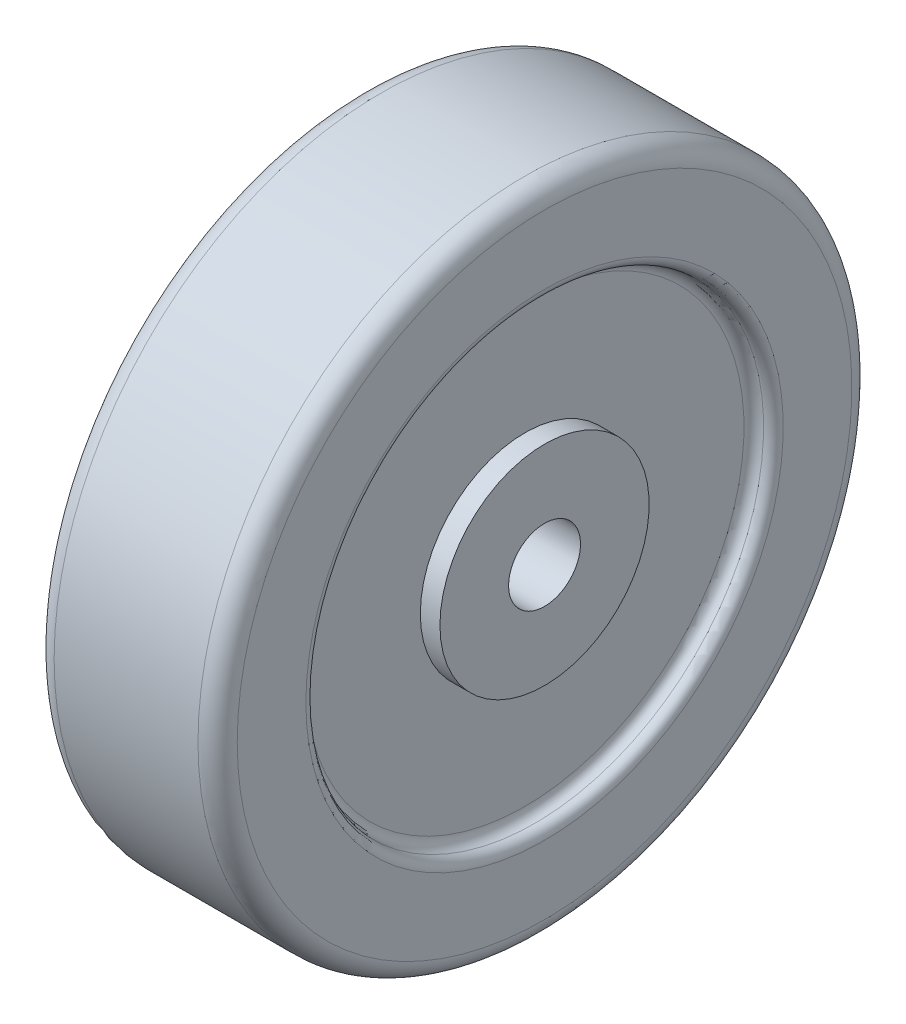
ISO-10303-21;
HEADER;
FILE_DESCRIPTION(('STEP AP214'),'2;1');
FILE_NAME('part.step','',(''),(''),'','','');
FILE_SCHEMA(('AUTOMOTIVE_DESIGN { 1 0 10303 214 1 1 1 1 }'));
ENDSEC;
DATA;
#1=APPLICATION_CONTEXT('core data for automotive mechanical design processes');
#2=APPLICATION_PROTOCOL_DEFINITION('international standard','automotive_design',2000,#1);
#3=PRODUCT_CONTEXT('',#1,'mechanical');
#4=PRODUCT('Part','Part','',(#3));
#5=PRODUCT_RELATED_PRODUCT_CATEGORY('part','',(#4));
#6=PRODUCT_DEFINITION_FORMATION('','',#4);
#7=PRODUCT_DEFINITION_CONTEXT('part definition',#1,'design');
#8=PRODUCT_DEFINITION('design','',#6,#7);
#9=PRODUCT_DEFINITION_SHAPE('','',#8);
#10=(LENGTH_UNIT() NAMED_UNIT(*) SI_UNIT(.MILLI.,.METRE.));
#11=(NAMED_UNIT(*) PLANE_ANGLE_UNIT() SI_UNIT($,.RADIAN.));
#12=(NAMED_UNIT(*) SI_UNIT($,.STERADIAN.) SOLID_ANGLE_UNIT());
#13=UNCERTAINTY_MEASURE_WITH_UNIT(LENGTH_MEASURE(1.E-05),#10,'distance_accuracy_value','');
#14=(GEOMETRIC_REPRESENTATION_CONTEXT(3) GLOBAL_UNCERTAINTY_ASSIGNED_CONTEXT((#13)) GLOBAL_UNIT_ASSIGNED_CONTEXT((#10,
#11,#12)) REPRESENTATION_CONTEXT('',''));
#15=CARTESIAN_POINT('',(0.,0.,0.));
#16=DIRECTION('',(0.,0.,1.));
#17=DIRECTION('',(1.,0.,0.));
#18=AXIS2_PLACEMENT_3D('',#15,#16,#17);
#19=CARTESIAN_POINT('',(0.,35.,0.));
#20=DIRECTION('',(1.,0.,0.));
#21=DIRECTION('',(0.,0.,-1.));
#22=AXIS2_PLACEMENT_3D('',#19,#20,#21);
#23=PLANE('',#22);
#24=CARTESIAN_POINT('',(0.,0.,0.));
#25=DIRECTION('',(1.,0.,0.));
#26=DIRECTION('',(0.,0.,-1.));
#27=AXIS2_PLACEMENT_3D('',#24,#25,#26);
#28=CIRCLE('',#27,36.5);
#29=CARTESIAN_POINT('',(0.,0.,-36.5));
#30=VERTEX_POINT('',#29);
#31=EDGE_CURVE('E39',#30,#30,#28,.T.);
#32=ORIENTED_EDGE('',*,*,#31,.T.);
#33=EDGE_LOOP('',(#32));
#34=FACE_BOUND('',#33,.T.);
#35=CARTESIAN_POINT('',(0.,0.,0.));
#36=DIRECTION('',(1.,0.,0.));
#37=DIRECTION('',(0.,0.,-1.));
#38=AXIS2_PLACEMENT_3D('',#35,#36,#37);
#39=CIRCLE('',#38,47.);
#40=CARTESIAN_POINT('',(0.,0.,-47.));
#41=VERTEX_POINT('',#40);
#42=EDGE_CURVE('E113',#41,#41,#39,.F.);
#43=ORIENTED_EDGE('',*,*,#42,.T.);
#44=EDGE_LOOP('',(#43));
#45=FACE_BOUND('',#44,.T.);
#46=ADVANCED_FACE('F31',(#34,#45),#23,.F.);
#47=CARTESIAN_POINT('',(0.,0.,0.));
#48=DIRECTION('',(-1.,0.,0.));
#49=DIRECTION('',(0.,0.,1.));
#50=AXIS2_PLACEMENT_3D('',#47,#48,#49);
#51=CYLINDRICAL_SURFACE('',#50,50.);
#52=CARTESIAN_POINT('',(3.,0.,0.));
#53=DIRECTION('',(1.,0.,0.));
#54=DIRECTION('',(0.,0.,-1.));
#55=AXIS2_PLACEMENT_3D('',#52,#53,#54);
#56=CIRCLE('',#55,50.);
#57=CARTESIAN_POINT('',(3.,0.,-50.));
#58=VERTEX_POINT('',#57);
#59=EDGE_CURVE('E107',#58,#58,#56,.T.);
#60=ORIENTED_EDGE('',*,*,#59,.T.);
#61=EDGE_LOOP('',(#60));
#62=FACE_BOUND('',#61,.T.);
#63=CARTESIAN_POINT('',(25.,0.,0.));
#64=DIRECTION('',(-1.,0.,0.));
#65=DIRECTION('',(0.,0.,1.));
#66=AXIS2_PLACEMENT_3D('',#63,#64,#65);
#67=CIRCLE('',#66,50.);
#68=CARTESIAN_POINT('',(25.,0.,50.));
#69=VERTEX_POINT('',#68);
#70=EDGE_CURVE('E110',#69,#69,#67,.T.);
#71=ORIENTED_EDGE('',*,*,#70,.T.);
#72=EDGE_LOOP('',(#71));
#73=FACE_BOUND('',#72,.T.);
#74=ADVANCED_FACE('F71',(#62,#73),#51,.T.);
#75=CARTESIAN_POINT('',(28.,50.,0.));
#76=DIRECTION('',(-1.,0.,0.));
#77=DIRECTION('',(0.,0.,1.));
#78=AXIS2_PLACEMENT_3D('',#75,#76,#77);
#79=PLANE('',#78);
#80=CARTESIAN_POINT('',(28.,0.,0.));
#81=DIRECTION('',(-1.,0.,0.));
#82=DIRECTION('',(0.,0.,1.));
#83=AXIS2_PLACEMENT_3D('',#80,#81,#82);
#84=CIRCLE('',#83,36.5);
#85=CARTESIAN_POINT('',(28.,0.,36.5));
#86=VERTEX_POINT('',#85);
#87=EDGE_CURVE('E100',#86,#86,#84,.T.);
#88=ORIENTED_EDGE('',*,*,#87,.T.);
#89=EDGE_LOOP('',(#88));
#90=FACE_BOUND('',#89,.T.);
#91=CARTESIAN_POINT('',(28.,0.,0.));
#92=DIRECTION('',(-1.,0.,0.));
#93=DIRECTION('',(0.,0.,1.));
#94=AXIS2_PLACEMENT_3D('',#91,#92,#93);
#95=CIRCLE('',#94,47.);
#96=CARTESIAN_POINT('',(28.,0.,47.));
#97=VERTEX_POINT('',#96);
#98=EDGE_CURVE('E102',#97,#97,#95,.F.);
#99=ORIENTED_EDGE('',*,*,#98,.T.);
#100=EDGE_LOOP('',(#99));
#101=FACE_BOUND('',#100,.T.);
#102=ADVANCED_FACE('F77',(#90,#101),#79,.F.);
#103=CARTESIAN_POINT('',(25.,35.,0.));
#104=DIRECTION('',(-1.,0.,0.));
#105=DIRECTION('',(0.,0.,1.));
#106=AXIS2_PLACEMENT_3D('',#103,#104,#105);
#107=PLANE('',#106);
#108=CARTESIAN_POINT('',(25.,0.,0.));
#109=DIRECTION('',(-1.,0.,0.));
#110=DIRECTION('',(0.,0.,1.));
#111=AXIS2_PLACEMENT_3D('',#108,#109,#110);
#112=CIRCLE('',#111,33.5);
#113=CARTESIAN_POINT('',(25.,0.,33.5));
#114=VERTEX_POINT('',#113);
#115=EDGE_CURVE('E44',#114,#114,#112,.F.);
#116=ORIENTED_EDGE('',*,*,#115,.T.);
#117=EDGE_LOOP('',(#116));
#118=FACE_BOUND('',#117,.T.);
#119=CARTESIAN_POINT('',(25.,0.,0.));
#120=DIRECTION('',(-1.,0.,0.));
#121=DIRECTION('',(0.,0.,1.));
#122=AXIS2_PLACEMENT_3D('',#119,#120,#121);
#123=CIRCLE('',#122,16.);
#124=CARTESIAN_POINT('',(25.,0.,16.));
#125=VERTEX_POINT('',#124);
#126=EDGE_CURVE('E116',#125,#125,#123,.T.);
#127=ORIENTED_EDGE('',*,*,#126,.T.);
#128=EDGE_LOOP('',(#127));
#129=FACE_BOUND('',#128,.T.);
#130=ADVANCED_FACE('F158',(#118,#129),#107,.F.);
#131=CARTESIAN_POINT('',(0.,0.,0.));
#132=DIRECTION('',(-1.,0.,0.));
#133=DIRECTION('',(0.,0.,1.));
#134=AXIS2_PLACEMENT_3D('',#131,#132,#133);
#135=CYLINDRICAL_SURFACE('',#134,16.);
#136=ORIENTED_EDGE('',*,*,#126,.F.);
#137=EDGE_LOOP('',(#136));
#138=FACE_BOUND('',#137,.T.);
#139=CARTESIAN_POINT('',(28.,0.,0.));
#140=DIRECTION('',(-1.,0.,0.));
#141=DIRECTION('',(0.,0.,1.));
#142=AXIS2_PLACEMENT_3D('',#139,#140,#141);
#143=CIRCLE('',#142,16.);
#144=CARTESIAN_POINT('',(28.,0.,16.));
#145=VERTEX_POINT('',#144);
#146=EDGE_CURVE('E119',#145,#145,#143,.T.);
#147=ORIENTED_EDGE('',*,*,#146,.T.);
#148=EDGE_LOOP('',(#147));
#149=FACE_BOUND('',#148,.T.);
#150=ADVANCED_FACE('F154',(#138,#149),#135,.T.);
#151=CARTESIAN_POINT('',(28.,16.,0.));
#152=DIRECTION('',(-1.,0.,0.));
#153=DIRECTION('',(0.,0.,1.));
#154=AXIS2_PLACEMENT_3D('',#151,#152,#153);
#155=PLANE('',#154);
#156=ORIENTED_EDGE('',*,*,#146,.F.);
#157=EDGE_LOOP('',(#156));
#158=FACE_BOUND('',#157,.T.);
#159=CARTESIAN_POINT('',(28.,0.,0.));
#160=DIRECTION('',(-1.,0.,0.));
#161=DIRECTION('',(0.,0.,1.));
#162=AXIS2_PLACEMENT_3D('',#159,#160,#161);
#163=CIRCLE('',#162,5.5);
#164=CARTESIAN_POINT('',(28.,0.,5.5));
#165=VERTEX_POINT('',#164);
#166=EDGE_CURVE('E122',#165,#165,#163,.T.);
#167=ORIENTED_EDGE('',*,*,#166,.T.);
#168=EDGE_LOOP('',(#167));
#169=FACE_BOUND('',#168,.T.);
#170=ADVANCED_FACE('F150',(#158,#169),#155,.F.);
#171=CARTESIAN_POINT('',(0.,0.,0.));
#172=DIRECTION('',(-1.,0.,0.));
#173=DIRECTION('',(0.,0.,1.));
#174=AXIS2_PLACEMENT_3D('',#171,#172,#173);
#175=CYLINDRICAL_SURFACE('',#174,5.5);
#176=ORIENTED_EDGE('',*,*,#166,.F.);
#177=EDGE_LOOP('',(#176));
#178=FACE_BOUND('',#177,.T.);
#179=CARTESIAN_POINT('',(0.,0.,0.));
#180=DIRECTION('',(-1.,0.,0.));
#181=DIRECTION('',(0.,0.,1.));
#182=AXIS2_PLACEMENT_3D('',#179,#180,#181);
#183=CIRCLE('',#182,5.5);
#184=CARTESIAN_POINT('',(0.,0.,5.5));
#185=VERTEX_POINT('',#184);
#186=EDGE_CURVE('E125',#185,#185,#183,.T.);
#187=ORIENTED_EDGE('',*,*,#186,.T.);
#188=EDGE_LOOP('',(#187));
#189=FACE_BOUND('',#188,.T.);
#190=ADVANCED_FACE('F146',(#178,#189),#175,.F.);
#191=CARTESIAN_POINT('',(0.,5.5,0.));
#192=DIRECTION('',(1.,0.,0.));
#193=DIRECTION('',(0.,0.,-1.));
#194=AXIS2_PLACEMENT_3D('',#191,#192,#193);
#195=PLANE('',#194);
#196=ORIENTED_EDGE('',*,*,#186,.F.);
#197=EDGE_LOOP('',(#196));
#198=FACE_BOUND('',#197,.T.);
#199=CARTESIAN_POINT('',(0.,0.,0.));
#200=DIRECTION('',(-1.,0.,0.));
#201=DIRECTION('',(0.,0.,1.));
#202=AXIS2_PLACEMENT_3D('',#199,#200,#201);
#203=CIRCLE('',#202,16.);
#204=CARTESIAN_POINT('',(0.,0.,16.));
#205=VERTEX_POINT('',#204);
#206=EDGE_CURVE('E53',#205,#205,#203,.T.);
#207=ORIENTED_EDGE('',*,*,#206,.T.);
#208=EDGE_LOOP('',(#207));
#209=FACE_BOUND('',#208,.T.);
#210=ADVANCED_FACE('F131',(#198,#209),#195,.F.);
#211=CARTESIAN_POINT('',(0.,0.,0.));
#212=DIRECTION('',(-1.,0.,0.));
#213=DIRECTION('',(0.,0.,1.));
#214=AXIS2_PLACEMENT_3D('',#211,#212,#213);
#215=CYLINDRICAL_SURFACE('',#214,16.);
#216=ORIENTED_EDGE('',*,*,#206,.F.);
#217=EDGE_LOOP('',(#216));
#218=FACE_BOUND('',#217,.T.);
#219=CARTESIAN_POINT('',(3.,0.,0.));
#220=DIRECTION('',(-1.,0.,0.));
#221=DIRECTION('',(0.,0.,1.));
#222=AXIS2_PLACEMENT_3D('',#219,#220,#221);
#223=CIRCLE('',#222,16.);
#224=CARTESIAN_POINT('',(3.,0.,16.));
#225=VERTEX_POINT('',#224);
#226=EDGE_CURVE('E49',#225,#225,#223,.T.);
#227=ORIENTED_EDGE('',*,*,#226,.T.);
#228=EDGE_LOOP('',(#227));
#229=FACE_BOUND('',#228,.T.);
#230=ADVANCED_FACE('F133',(#218,#229),#215,.T.);
#231=CARTESIAN_POINT('',(3.,16.,0.));
#232=DIRECTION('',(1.,0.,0.));
#233=DIRECTION('',(0.,0.,-1.));
#234=AXIS2_PLACEMENT_3D('',#231,#232,#233);
#235=PLANE('',#234);
#236=CARTESIAN_POINT('',(3.,0.,0.));
#237=DIRECTION('',(1.,0.,0.));
#238=DIRECTION('',(0.,0.,-1.));
#239=AXIS2_PLACEMENT_3D('',#236,#237,#238);
#240=CIRCLE('',#239,33.5);
#241=CARTESIAN_POINT('',(3.,0.,-33.5));
#242=VERTEX_POINT('',#241);
#243=EDGE_CURVE('E10',#242,#242,#240,.F.);
#244=ORIENTED_EDGE('',*,*,#243,.T.);
#245=EDGE_LOOP('',(#244));
#246=FACE_BOUND('',#245,.T.);
#247=ORIENTED_EDGE('',*,*,#226,.F.);
#248=EDGE_LOOP('',(#247));
#249=FACE_BOUND('',#248,.T.);
#250=ADVANCED_FACE('F87',(#246,#249),#235,.F.);
#251=CARTESIAN_POINT('',(3.,0.,0.));
#252=DIRECTION('',(1.,0.,0.));
#253=DIRECTION('',(0.,0.,-1.));
#254=AXIS2_PLACEMENT_3D('',#251,#252,#253);
#255=TOROIDAL_SURFACE('',#254,47.,3.);
#256=ORIENTED_EDGE('',*,*,#59,.F.);
#257=EDGE_LOOP('',(#256));
#258=FACE_BOUND('',#257,.T.);
#259=ORIENTED_EDGE('',*,*,#42,.F.);
#260=EDGE_LOOP('',(#259));
#261=FACE_BOUND('',#260,.T.);
#262=ADVANCED_FACE('F83',(#258,#261),#255,.T.);
#263=CARTESIAN_POINT('',(25.,0.,0.));
#264=DIRECTION('',(-1.,0.,0.));
#265=DIRECTION('',(0.,0.,1.));
#266=AXIS2_PLACEMENT_3D('',#263,#264,#265);
#267=TOROIDAL_SURFACE('',#266,47.,3.);
#268=ORIENTED_EDGE('',*,*,#98,.F.);
#269=EDGE_LOOP('',(#268));
#270=FACE_BOUND('',#269,.T.);
#271=ORIENTED_EDGE('',*,*,#70,.F.);
#272=EDGE_LOOP('',(#271));
#273=FACE_BOUND('',#272,.T.);
#274=ADVANCED_FACE('F86',(#270,#273),#267,.T.);
#275=CARTESIAN_POINT('',(26.5,0.,0.));
#276=DIRECTION('',(-1.,0.,0.));
#277=DIRECTION('',(0.,0.,1.));
#278=AXIS2_PLACEMENT_3D('',#275,#276,#277);
#279=TOROIDAL_SURFACE('',#278,33.5,1.5);
#280=ORIENTED_EDGE('',*,*,#115,.F.);
#281=EDGE_LOOP('',(#280));
#282=FACE_BOUND('',#281,.T.);
#283=CARTESIAN_POINT('',(26.5,0.,0.));
#284=DIRECTION('',(-1.,0.,0.));
#285=DIRECTION('',(0.,0.,1.));
#286=AXIS2_PLACEMENT_3D('',#283,#284,#285);
#287=CIRCLE('',#286,35.);
#288=CARTESIAN_POINT('',(26.5,0.,35.));
#289=VERTEX_POINT('',#288);
#290=EDGE_CURVE('E47',#289,#289,#287,.T.);
#291=ORIENTED_EDGE('',*,*,#290,.F.);
#292=EDGE_LOOP('',(#291));
#293=FACE_BOUND('',#292,.T.);
#294=ADVANCED_FACE('F68',(#282,#293),#279,.F.);
#295=CARTESIAN_POINT('',(26.5,0.,0.));
#296=DIRECTION('',(-1.,0.,0.));
#297=DIRECTION('',(0.,0.,1.));
#298=AXIS2_PLACEMENT_3D('',#295,#296,#297);
#299=TOROIDAL_SURFACE('',#298,36.5,1.5);
#300=ORIENTED_EDGE('',*,*,#290,.T.);
#301=EDGE_LOOP('',(#300));
#302=FACE_BOUND('',#301,.T.);
#303=ORIENTED_EDGE('',*,*,#87,.F.);
#304=EDGE_LOOP('',(#303));
#305=FACE_BOUND('',#304,.T.);
#306=ADVANCED_FACE('F61',(#302,#305),#299,.T.);
#307=CARTESIAN_POINT('',(1.5,0.,0.));
#308=DIRECTION('',(1.,0.,0.));
#309=DIRECTION('',(0.,0.,-1.));
#310=AXIS2_PLACEMENT_3D('',#307,#308,#309);
#311=TOROIDAL_SURFACE('',#310,33.5,1.5);
#312=ORIENTED_EDGE('',*,*,#243,.F.);
#313=EDGE_LOOP('',(#312));
#314=FACE_BOUND('',#313,.T.);
#315=CARTESIAN_POINT('',(1.5,0.,0.));
#316=DIRECTION('',(1.,0.,0.));
#317=DIRECTION('',(0.,0.,-1.));
#318=AXIS2_PLACEMENT_3D('',#315,#316,#317);
#319=CIRCLE('',#318,35.);
#320=CARTESIAN_POINT('',(1.5,0.,-35.));
#321=VERTEX_POINT('',#320);
#322=EDGE_CURVE('E35',#321,#321,#319,.T.);
#323=ORIENTED_EDGE('',*,*,#322,.F.);
#324=EDGE_LOOP('',(#323));
#325=FACE_BOUND('',#324,.T.);
#326=ADVANCED_FACE('F33',(#314,#325),#311,.F.);
#327=CARTESIAN_POINT('',(1.5,0.,0.));
#328=DIRECTION('',(1.,0.,0.));
#329=DIRECTION('',(0.,0.,-1.));
#330=AXIS2_PLACEMENT_3D('',#327,#328,#329);
#331=TOROIDAL_SURFACE('',#330,36.5,1.5);
#332=ORIENTED_EDGE('',*,*,#31,.F.);
#333=EDGE_LOOP('',(#332));
#334=FACE_BOUND('',#333,.T.);
#335=ORIENTED_EDGE('',*,*,#322,.T.);
#336=EDGE_LOOP('',(#335));
#337=FACE_BOUND('',#336,.T.);
#338=ADVANCED_FACE('F58',(#334,#337),#331,.T.);
#339=CLOSED_SHELL('',(#46,#74,#102,#130,#150,#170,#190,#210,#230,#250,#262,#274,#294,#306,#326,#338));
#340=MANIFOLD_SOLID_BREP('B2',#339);
#341=ADVANCED_BREP_SHAPE_REPRESENTATION('',(#18,#340),#14);
#342=SHAPE_DEFINITION_REPRESENTATION(#9,#341);
ENDSEC;
END-ISO-10303-21;
